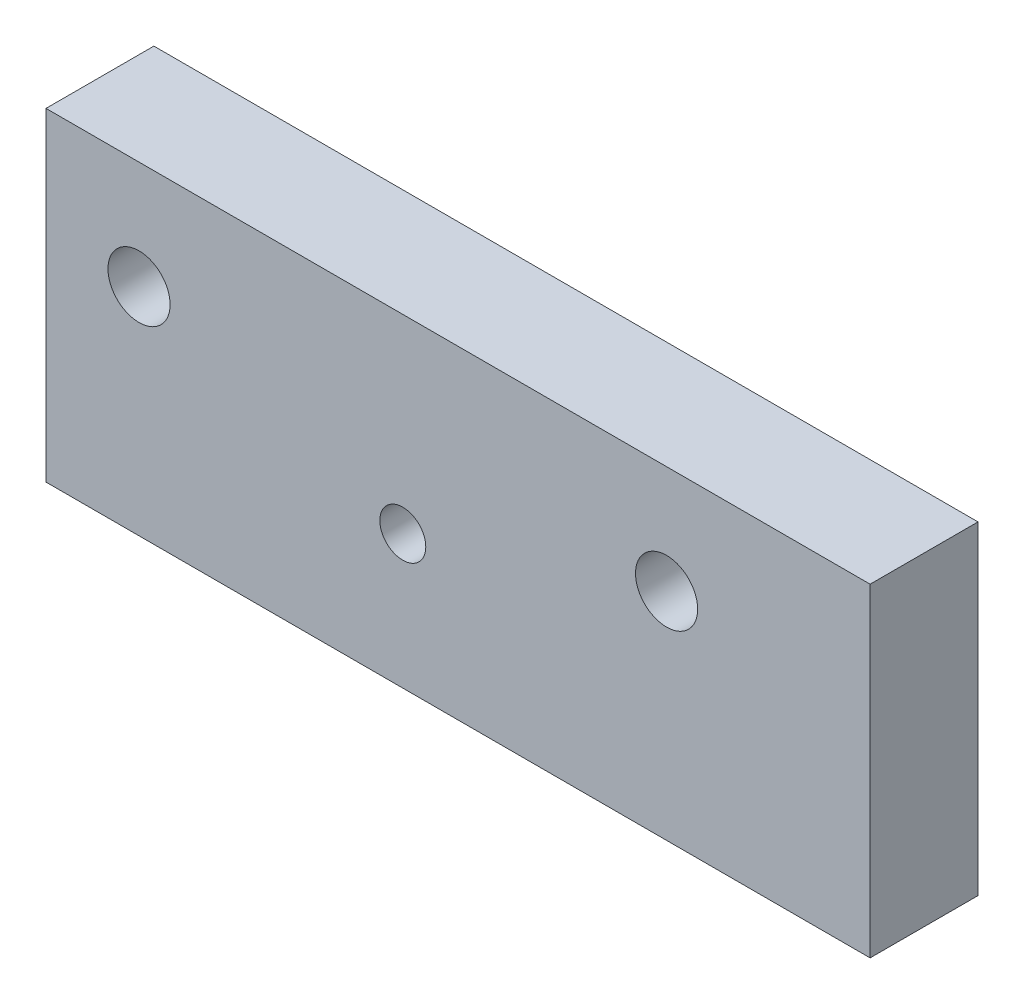
ISO-10303-21;
HEADER;
FILE_DESCRIPTION(('STEP AP214'),'2;1');
FILE_NAME('part.step','',(''),(''),'','','');
FILE_SCHEMA(('AUTOMOTIVE_DESIGN { 1 0 10303 214 1 1 1 1 }'));
ENDSEC;
DATA;
#1=APPLICATION_CONTEXT('core data for automotive mechanical design processes');
#2=APPLICATION_PROTOCOL_DEFINITION('international standard','automotive_design',2000,#1);
#3=PRODUCT_CONTEXT('',#1,'mechanical');
#4=PRODUCT('Part','Part','',(#3));
#5=PRODUCT_RELATED_PRODUCT_CATEGORY('part','',(#4));
#6=PRODUCT_DEFINITION_FORMATION('','',#4);
#7=PRODUCT_DEFINITION_CONTEXT('part definition',#1,'design');
#8=PRODUCT_DEFINITION('design','',#6,#7);
#9=PRODUCT_DEFINITION_SHAPE('','',#8);
#10=(LENGTH_UNIT() NAMED_UNIT(*) SI_UNIT(.MILLI.,.METRE.));
#11=(NAMED_UNIT(*) PLANE_ANGLE_UNIT() SI_UNIT($,.RADIAN.));
#12=(NAMED_UNIT(*) SI_UNIT($,.STERADIAN.) SOLID_ANGLE_UNIT());
#13=UNCERTAINTY_MEASURE_WITH_UNIT(LENGTH_MEASURE(1.E-05),#10,'distance_accuracy_value','');
#14=(GEOMETRIC_REPRESENTATION_CONTEXT(3) GLOBAL_UNCERTAINTY_ASSIGNED_CONTEXT((#13)) GLOBAL_UNIT_ASSIGNED_CONTEXT((#10,
#11,#12)) REPRESENTATION_CONTEXT('',''));
#15=CARTESIAN_POINT('',(0.,0.,0.));
#16=DIRECTION('',(0.,0.,1.));
#17=DIRECTION('',(1.,0.,0.));
#18=AXIS2_PLACEMENT_3D('',#15,#16,#17);
#19=CARTESIAN_POINT('',(15.525,0.,6.35));
#20=DIRECTION('',(0.,0.,1.));
#21=DIRECTION('',(1.,0.,0.));
#22=AXIS2_PLACEMENT_3D('',#19,#20,#21);
#23=CYLINDRICAL_SURFACE('',#22,1.8288);
#24=CARTESIAN_POINT('',(15.525,0.,6.35));
#25=DIRECTION('',(0.,0.,1.));
#26=DIRECTION('',(1.,0.,0.));
#27=AXIS2_PLACEMENT_3D('',#24,#25,#26);
#28=CIRCLE('',#27,1.8288);
#29=CARTESIAN_POINT('',(17.3538,0.,6.35));
#30=VERTEX_POINT('',#29);
#31=EDGE_CURVE('E105',#30,#30,#28,.T.);
#32=ORIENTED_EDGE('',*,*,#31,.T.);
#33=EDGE_LOOP('',(#32));
#34=FACE_BOUND('',#33,.T.);
#35=CARTESIAN_POINT('',(15.525,0.,2.));
#36=DIRECTION('',(0.,0.,-1.));
#37=DIRECTION('',(-1.,0.,0.));
#38=AXIS2_PLACEMENT_3D('',#35,#36,#37);
#39=CIRCLE('',#38,1.8288);
#40=CARTESIAN_POINT('',(13.6962,0.,2.));
#41=VERTEX_POINT('',#40);
#42=EDGE_CURVE('E39',#41,#41,#39,.F.);
#43=ORIENTED_EDGE('',*,*,#42,.F.);
#44=EDGE_LOOP('',(#43));
#45=FACE_BOUND('',#44,.T.);
#46=ADVANCED_FACE('F35',(#34,#45),#23,.F.);
#47=CARTESIAN_POINT('',(-15.525,0.,6.35));
#48=DIRECTION('',(0.,0.,1.));
#49=DIRECTION('',(1.,0.,0.));
#50=AXIS2_PLACEMENT_3D('',#47,#48,#49);
#51=CYLINDRICAL_SURFACE('',#50,1.8288);
#52=CARTESIAN_POINT('',(-15.525,0.,6.35));
#53=DIRECTION('',(0.,0.,1.));
#54=DIRECTION('',(1.,0.,0.));
#55=AXIS2_PLACEMENT_3D('',#52,#53,#54);
#56=CIRCLE('',#55,1.8288);
#57=CARTESIAN_POINT('',(-13.6962,0.,6.35));
#58=VERTEX_POINT('',#57);
#59=EDGE_CURVE('E116',#58,#58,#56,.T.);
#60=ORIENTED_EDGE('',*,*,#59,.T.);
#61=EDGE_LOOP('',(#60));
#62=FACE_BOUND('',#61,.T.);
#63=CARTESIAN_POINT('',(-15.525,0.,2.));
#64=DIRECTION('',(0.,0.,-1.));
#65=DIRECTION('',(-1.,0.,0.));
#66=AXIS2_PLACEMENT_3D('',#63,#64,#65);
#67=CIRCLE('',#66,1.8288);
#68=CARTESIAN_POINT('',(-17.3538,0.,2.));
#69=VERTEX_POINT('',#68);
#70=EDGE_CURVE('E110',#69,#69,#67,.F.);
#71=ORIENTED_EDGE('',*,*,#70,.F.);
#72=EDGE_LOOP('',(#71));
#73=FACE_BOUND('',#72,.T.);
#74=ADVANCED_FACE('F159',(#62,#73),#51,.F.);
#75=CARTESIAN_POINT('',(-21.,6.35,6.35));
#76=DIRECTION('',(1.,0.,0.));
#77=DIRECTION('',(0.,0.,-1.));
#78=AXIS2_PLACEMENT_3D('',#75,#76,#77);
#79=PLANE('',#78);
#80=DIRECTION('',(0.,-1.,0.));
#81=VECTOR('',#80,1.);
#82=CARTESIAN_POINT('',(-21.,6.35,0.));
#83=LINE('',#82,#81);
#84=CARTESIAN_POINT('',(-21.,6.35,0.));
#85=VERTEX_POINT('',#84);
#86=CARTESIAN_POINT('',(-21.,-12.7,0.));
#87=VERTEX_POINT('',#86);
#88=EDGE_CURVE('E102',#85,#87,#83,.T.);
#89=ORIENTED_EDGE('',*,*,#88,.T.);
#90=DIRECTION('',(0.,0.,-1.));
#91=VECTOR('',#90,1.);
#92=CARTESIAN_POINT('',(-21.,-12.7,6.35));
#93=LINE('',#92,#91);
#94=CARTESIAN_POINT('',(-21.,-12.7,6.35));
#95=VERTEX_POINT('',#94);
#96=EDGE_CURVE('E11',#95,#87,#93,.T.);
#97=ORIENTED_EDGE('',*,*,#96,.F.);
#98=DIRECTION('',(0.,-1.,0.));
#99=VECTOR('',#98,1.);
#100=CARTESIAN_POINT('',(-21.,6.35,6.35));
#101=LINE('',#100,#99);
#102=CARTESIAN_POINT('',(-21.,6.35,6.35));
#103=VERTEX_POINT('',#102);
#104=EDGE_CURVE('E89',#103,#95,#101,.T.);
#105=ORIENTED_EDGE('',*,*,#104,.F.);
#106=DIRECTION('',(0.,0.,-1.));
#107=VECTOR('',#106,1.);
#108=CARTESIAN_POINT('',(-21.,6.35,6.35));
#109=LINE('',#108,#107);
#110=EDGE_CURVE('E98',#103,#85,#109,.T.);
#111=ORIENTED_EDGE('',*,*,#110,.T.);
#112=EDGE_LOOP('',(#89,#97,#105,#111));
#113=FACE_BOUND('',#112,.T.);
#114=ADVANCED_FACE('F37',(#113),#79,.F.);
#115=CARTESIAN_POINT('',(-21.,-12.7,6.35));
#116=DIRECTION('',(0.,1.,0.));
#117=DIRECTION('',(0.,0.,1.));
#118=AXIS2_PLACEMENT_3D('',#115,#116,#117);
#119=PLANE('',#118);
#120=DIRECTION('',(1.,0.,0.));
#121=VECTOR('',#120,1.);
#122=CARTESIAN_POINT('',(-21.,-12.7,0.));
#123=LINE('',#122,#121);
#124=CARTESIAN_POINT('',(27.505,-12.7,0.));
#125=VERTEX_POINT('',#124);
#126=EDGE_CURVE('E93',#87,#125,#123,.T.);
#127=ORIENTED_EDGE('',*,*,#126,.T.);
#128=DIRECTION('',(0.,0.,-1.));
#129=VECTOR('',#128,1.);
#130=CARTESIAN_POINT('',(27.505,-12.7,6.35));
#131=LINE('',#130,#129);
#132=CARTESIAN_POINT('',(27.505,-12.7,6.35));
#133=VERTEX_POINT('',#132);
#134=EDGE_CURVE('E45',#133,#125,#131,.T.);
#135=ORIENTED_EDGE('',*,*,#134,.F.);
#136=DIRECTION('',(1.,0.,0.));
#137=VECTOR('',#136,1.);
#138=CARTESIAN_POINT('',(-21.,-12.7,6.35));
#139=LINE('',#138,#137);
#140=EDGE_CURVE('E84',#95,#133,#139,.T.);
#141=ORIENTED_EDGE('',*,*,#140,.F.);
#142=ORIENTED_EDGE('',*,*,#96,.T.);
#143=EDGE_LOOP('',(#127,#135,#141,#142));
#144=FACE_BOUND('',#143,.T.);
#145=ADVANCED_FACE('F92',(#144),#119,.F.);
#146=CARTESIAN_POINT('',(27.505,6.35,6.35));
#147=DIRECTION('',(-1.,0.,0.));
#148=DIRECTION('',(0.,0.,1.));
#149=AXIS2_PLACEMENT_3D('',#146,#147,#148);
#150=PLANE('',#149);
#151=DIRECTION('',(0.,1.,0.));
#152=VECTOR('',#151,1.);
#153=CARTESIAN_POINT('',(27.505,6.35,0.));
#154=LINE('',#153,#152);
#155=CARTESIAN_POINT('',(27.505,6.35,0.));
#156=VERTEX_POINT('',#155);
#157=EDGE_CURVE('E71',#125,#156,#154,.T.);
#158=ORIENTED_EDGE('',*,*,#157,.T.);
#159=DIRECTION('',(0.,0.,-1.));
#160=VECTOR('',#159,1.);
#161=CARTESIAN_POINT('',(27.505,6.35,6.35));
#162=LINE('',#161,#160);
#163=CARTESIAN_POINT('',(27.505,6.35,6.35));
#164=VERTEX_POINT('',#163);
#165=EDGE_CURVE('E94',#164,#156,#162,.T.);
#166=ORIENTED_EDGE('',*,*,#165,.F.);
#167=DIRECTION('',(0.,1.,0.));
#168=VECTOR('',#167,1.);
#169=CARTESIAN_POINT('',(27.505,6.35,6.35));
#170=LINE('',#169,#168);
#171=EDGE_CURVE('E87',#133,#164,#170,.T.);
#172=ORIENTED_EDGE('',*,*,#171,.F.);
#173=ORIENTED_EDGE('',*,*,#134,.T.);
#174=EDGE_LOOP('',(#158,#166,#172,#173));
#175=FACE_BOUND('',#174,.T.);
#176=ADVANCED_FACE('F96',(#175),#150,.F.);
#177=CARTESIAN_POINT('',(-21.,6.35,6.35));
#178=DIRECTION('',(0.,-1.,0.));
#179=DIRECTION('',(0.,0.,-1.));
#180=AXIS2_PLACEMENT_3D('',#177,#178,#179);
#181=PLANE('',#180);
#182=DIRECTION('',(-1.,0.,0.));
#183=VECTOR('',#182,1.);
#184=CARTESIAN_POINT('',(-21.,6.35,0.));
#185=LINE('',#184,#183);
#186=EDGE_CURVE('E77',#156,#85,#185,.T.);
#187=ORIENTED_EDGE('',*,*,#186,.T.);
#188=ORIENTED_EDGE('',*,*,#110,.F.);
#189=DIRECTION('',(-1.,0.,0.));
#190=VECTOR('',#189,1.);
#191=CARTESIAN_POINT('',(-21.,6.35,6.35));
#192=LINE('',#191,#190);
#193=EDGE_CURVE('E54',#164,#103,#192,.T.);
#194=ORIENTED_EDGE('',*,*,#193,.F.);
#195=ORIENTED_EDGE('',*,*,#165,.T.);
#196=EDGE_LOOP('',(#187,#188,#194,#195));
#197=FACE_BOUND('',#196,.T.);
#198=ADVANCED_FACE('F143',(#197),#181,.F.);
#199=CARTESIAN_POINT('',(0.,0.,6.35));
#200=DIRECTION('',(0.,0.,1.));
#201=DIRECTION('',(1.,0.,0.));
#202=AXIS2_PLACEMENT_3D('',#199,#200,#201);
#203=PLANE('',#202);
#204=CARTESIAN_POINT('',(0.,-4.8294,6.35));
#205=DIRECTION('',(0.,0.,1.));
#206=DIRECTION('',(1.,0.,0.));
#207=AXIS2_PLACEMENT_3D('',#204,#205,#206);
#208=CIRCLE('',#207,1.35255);
#209=CARTESIAN_POINT('',(1.35255,-4.8294,6.35));
#210=VERTEX_POINT('',#209);
#211=EDGE_CURVE('E126',#210,#210,#208,.T.);
#212=ORIENTED_EDGE('',*,*,#211,.F.);
#213=EDGE_LOOP('',(#212));
#214=FACE_BOUND('',#213,.T.);
#215=ORIENTED_EDGE('',*,*,#59,.F.);
#216=EDGE_LOOP('',(#215));
#217=FACE_BOUND('',#216,.T.);
#218=ORIENTED_EDGE('',*,*,#31,.F.);
#219=EDGE_LOOP('',(#218));
#220=FACE_BOUND('',#219,.T.);
#221=ORIENTED_EDGE('',*,*,#104,.T.);
#222=ORIENTED_EDGE('',*,*,#140,.T.);
#223=ORIENTED_EDGE('',*,*,#171,.T.);
#224=ORIENTED_EDGE('',*,*,#193,.T.);
#225=EDGE_LOOP('',(#221,#222,#223,#224));
#226=FACE_BOUND('',#225,.T.);
#227=ADVANCED_FACE('F85',(#214,#217,#220,#226),#203,.T.);
#228=CARTESIAN_POINT('',(0.,0.,0.));
#229=DIRECTION('',(0.,0.,1.));
#230=DIRECTION('',(1.,0.,0.));
#231=AXIS2_PLACEMENT_3D('',#228,#229,#230);
#232=PLANE('',#231);
#233=CARTESIAN_POINT('',(0.,-4.8294,0.));
#234=DIRECTION('',(0.,0.,-1.));
#235=DIRECTION('',(-1.,0.,0.));
#236=AXIS2_PLACEMENT_3D('',#233,#234,#235);
#237=CIRCLE('',#236,1.35255);
#238=CARTESIAN_POINT('',(-1.35255,-4.8294,0.));
#239=VERTEX_POINT('',#238);
#240=EDGE_CURVE('E189',#239,#239,#237,.T.);
#241=ORIENTED_EDGE('',*,*,#240,.F.);
#242=EDGE_LOOP('',(#241));
#243=FACE_BOUND('',#242,.T.);
#244=CARTESIAN_POINT('',(15.525,0.,0.));
#245=DIRECTION('',(0.,0.,-1.));
#246=DIRECTION('',(-1.,0.,0.));
#247=AXIS2_PLACEMENT_3D('',#244,#245,#246);
#248=CIRCLE('',#247,4.7625);
#249=CARTESIAN_POINT('',(10.7625,0.,0.));
#250=VERTEX_POINT('',#249);
#251=EDGE_CURVE('E118',#250,#250,#248,.T.);
#252=ORIENTED_EDGE('',*,*,#251,.F.);
#253=EDGE_LOOP('',(#252));
#254=FACE_BOUND('',#253,.T.);
#255=CARTESIAN_POINT('',(-15.525,0.,0.));
#256=DIRECTION('',(0.,0.,-1.));
#257=DIRECTION('',(-1.,0.,0.));
#258=AXIS2_PLACEMENT_3D('',#255,#256,#257);
#259=CIRCLE('',#258,4.7625);
#260=CARTESIAN_POINT('',(-20.2875,0.,0.));
#261=VERTEX_POINT('',#260);
#262=EDGE_CURVE('E131',#261,#261,#259,.T.);
#263=ORIENTED_EDGE('',*,*,#262,.F.);
#264=EDGE_LOOP('',(#263));
#265=FACE_BOUND('',#264,.T.);
#266=ORIENTED_EDGE('',*,*,#88,.F.);
#267=ORIENTED_EDGE('',*,*,#186,.F.);
#268=ORIENTED_EDGE('',*,*,#157,.F.);
#269=ORIENTED_EDGE('',*,*,#126,.F.);
#270=EDGE_LOOP('',(#266,#267,#268,#269));
#271=FACE_BOUND('',#270,.T.);
#272=ADVANCED_FACE('F142',(#243,#254,#265,#271),#232,.F.);
#273=CARTESIAN_POINT('',(-15.525,0.,2.));
#274=DIRECTION('',(0.,0.,-1.));
#275=DIRECTION('',(-1.,0.,0.));
#276=AXIS2_PLACEMENT_3D('',#273,#274,#275);
#277=PLANE('',#276);
#278=CARTESIAN_POINT('',(-15.525,0.,2.));
#279=DIRECTION('',(0.,0.,-1.));
#280=DIRECTION('',(-1.,0.,0.));
#281=AXIS2_PLACEMENT_3D('',#278,#279,#280);
#282=CIRCLE('',#281,4.7625);
#283=CARTESIAN_POINT('',(-20.2875,0.,2.));
#284=VERTEX_POINT('',#283);
#285=EDGE_CURVE('E123',#284,#284,#282,.T.);
#286=ORIENTED_EDGE('',*,*,#285,.T.);
#287=EDGE_LOOP('',(#286));
#288=FACE_BOUND('',#287,.T.);
#289=ORIENTED_EDGE('',*,*,#70,.T.);
#290=EDGE_LOOP('',(#289));
#291=FACE_BOUND('',#290,.T.);
#292=ADVANCED_FACE('F150',(#288,#291),#277,.T.);
#293=CARTESIAN_POINT('',(-15.525,0.,2.));
#294=DIRECTION('',(0.,0.,-1.));
#295=DIRECTION('',(-1.,0.,0.));
#296=AXIS2_PLACEMENT_3D('',#293,#294,#295);
#297=CYLINDRICAL_SURFACE('',#296,4.7625);
#298=ORIENTED_EDGE('',*,*,#285,.F.);
#299=EDGE_LOOP('',(#298));
#300=FACE_BOUND('',#299,.T.);
#301=ORIENTED_EDGE('',*,*,#262,.T.);
#302=EDGE_LOOP('',(#301));
#303=FACE_BOUND('',#302,.T.);
#304=ADVANCED_FACE('F166',(#300,#303),#297,.F.);
#305=CARTESIAN_POINT('',(15.525,0.,2.));
#306=DIRECTION('',(0.,0.,-1.));
#307=DIRECTION('',(-1.,0.,0.));
#308=AXIS2_PLACEMENT_3D('',#305,#306,#307);
#309=PLANE('',#308);
#310=CARTESIAN_POINT('',(15.525,0.,2.));
#311=DIRECTION('',(0.,0.,-1.));
#312=DIRECTION('',(-1.,0.,0.));
#313=AXIS2_PLACEMENT_3D('',#310,#311,#312);
#314=CIRCLE('',#313,4.7625);
#315=CARTESIAN_POINT('',(10.7625,0.,2.));
#316=VERTEX_POINT('',#315);
#317=EDGE_CURVE('E112',#316,#316,#314,.T.);
#318=ORIENTED_EDGE('',*,*,#317,.T.);
#319=EDGE_LOOP('',(#318));
#320=FACE_BOUND('',#319,.T.);
#321=ORIENTED_EDGE('',*,*,#42,.T.);
#322=EDGE_LOOP('',(#321));
#323=FACE_BOUND('',#322,.T.);
#324=ADVANCED_FACE('F169',(#320,#323),#309,.T.);
#325=CARTESIAN_POINT('',(15.525,0.,2.));
#326=DIRECTION('',(0.,0.,-1.));
#327=DIRECTION('',(-1.,0.,0.));
#328=AXIS2_PLACEMENT_3D('',#325,#326,#327);
#329=CYLINDRICAL_SURFACE('',#328,4.7625);
#330=ORIENTED_EDGE('',*,*,#317,.F.);
#331=EDGE_LOOP('',(#330));
#332=FACE_BOUND('',#331,.T.);
#333=ORIENTED_EDGE('',*,*,#251,.T.);
#334=EDGE_LOOP('',(#333));
#335=FACE_BOUND('',#334,.T.);
#336=ADVANCED_FACE('F174',(#332,#335),#329,.F.);
#337=CARTESIAN_POINT('',(0.,-4.8294,0.));
#338=DIRECTION('',(0.,0.,-1.));
#339=DIRECTION('',(-1.,0.,0.));
#340=AXIS2_PLACEMENT_3D('',#337,#338,#339);
#341=CYLINDRICAL_SURFACE('',#340,1.35255);
#342=ORIENTED_EDGE('',*,*,#211,.T.);
#343=EDGE_LOOP('',(#342));
#344=FACE_BOUND('',#343,.T.);
#345=ORIENTED_EDGE('',*,*,#240,.T.);
#346=EDGE_LOOP('',(#345));
#347=FACE_BOUND('',#346,.T.);
#348=ADVANCED_FACE('F177',(#344,#347),#341,.F.);
#349=CLOSED_SHELL('',(#46,#74,#114,#145,#176,#198,#227,#272,#292,#304,#324,#336,#348));
#350=MANIFOLD_SOLID_BREP('B2',#349);
#351=ADVANCED_BREP_SHAPE_REPRESENTATION('',(#18,#350),#14);
#352=SHAPE_DEFINITION_REPRESENTATION(#9,#351);
ENDSEC;
END-ISO-10303-21;
